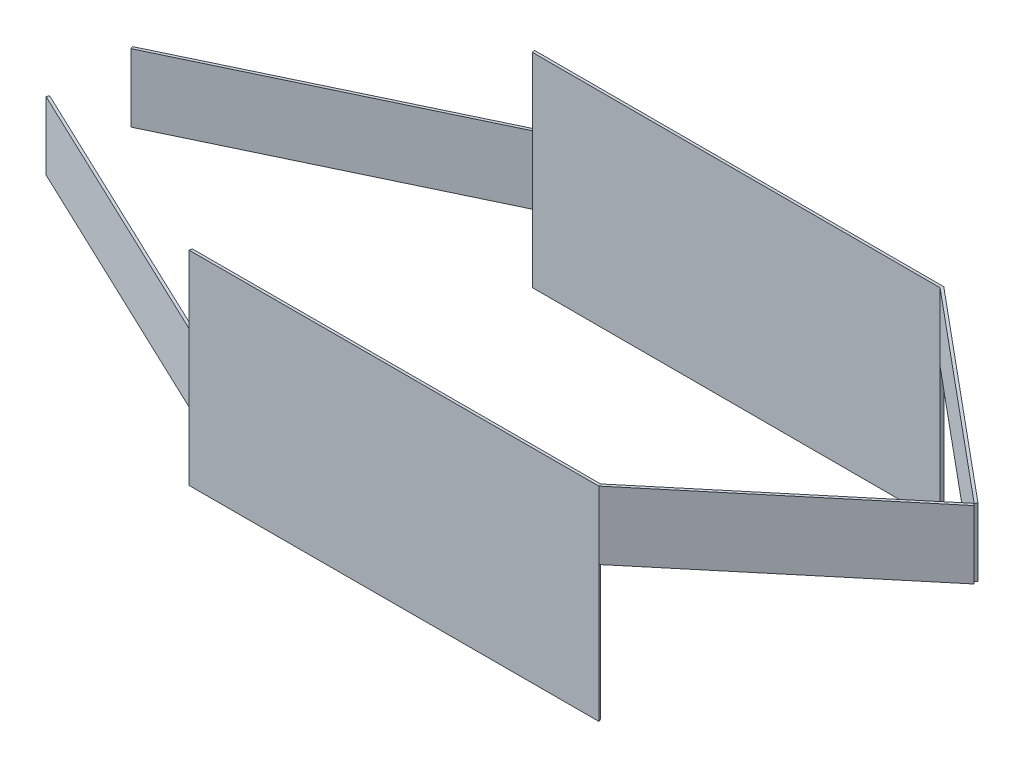
ISO-10303-21;
HEADER;
FILE_DESCRIPTION(('STEP AP214'),'2;1');
FILE_NAME('part.step','',(''),(''),'','','');
FILE_SCHEMA(('AUTOMOTIVE_DESIGN { 1 0 10303 214 1 1 1 1 }'));
ENDSEC;
DATA;
#1=APPLICATION_CONTEXT('core data for automotive mechanical design processes');
#2=APPLICATION_PROTOCOL_DEFINITION('international standard','automotive_design',2000,#1);
#3=PRODUCT_CONTEXT('',#1,'mechanical');
#4=PRODUCT('Part','Part','',(#3));
#5=PRODUCT_RELATED_PRODUCT_CATEGORY('part','',(#4));
#6=PRODUCT_DEFINITION_FORMATION('','',#4);
#7=PRODUCT_DEFINITION_CONTEXT('part definition',#1,'design');
#8=PRODUCT_DEFINITION('design','',#6,#7);
#9=PRODUCT_DEFINITION_SHAPE('','',#8);
#10=(LENGTH_UNIT() NAMED_UNIT(*) SI_UNIT(.MILLI.,.METRE.));
#11=(NAMED_UNIT(*) PLANE_ANGLE_UNIT() SI_UNIT($,.RADIAN.));
#12=(NAMED_UNIT(*) SI_UNIT($,.STERADIAN.) SOLID_ANGLE_UNIT());
#13=UNCERTAINTY_MEASURE_WITH_UNIT(LENGTH_MEASURE(1.E-05),#10,'distance_accuracy_value','');
#14=(GEOMETRIC_REPRESENTATION_CONTEXT(3) GLOBAL_UNCERTAINTY_ASSIGNED_CONTEXT((#13)) GLOBAL_UNIT_ASSIGNED_CONTEXT((#10,
#11,#12)) REPRESENTATION_CONTEXT('',''));
#15=CARTESIAN_POINT('',(0.,0.,0.));
#16=DIRECTION('',(0.,0.,1.));
#17=DIRECTION('',(1.,0.,0.));
#18=AXIS2_PLACEMENT_3D('',#15,#16,#17);
#19=CARTESIAN_POINT('',(23.3216797780839,-200.,11.0785547963605));
#20=DIRECTION('',(-0.903266142648768,0.,-0.429080733131209));
#21=DIRECTION('',(-0.42908073313121,0.,0.903266142648768));
#22=AXIS2_PLACEMENT_3D('',#19,#20,#21);
#23=PLANE('',#22);
#24=DIRECTION('',(-0.42908073313121,0.,0.903266142648768));
#25=VECTOR('',#24,1.);
#26=CARTESIAN_POINT('',(23.3216797780839,-100.,11.0785547963605));
#27=LINE('',#26,#25);
#28=CARTESIAN_POINT('',(0.0824257389479277,-100.,59.9999575374764));
#29=VERTEX_POINT('',#28);
#30=CARTESIAN_POINT('',(-1.63389719357689,-100.,63.6130221080714));
#31=VERTEX_POINT('',#30);
#32=EDGE_CURVE('E108',#29,#31,#27,.T.);
#33=ORIENTED_EDGE('',*,*,#32,.F.);
#34=DIRECTION('',(0.,1.,0.));
#35=VECTOR('',#34,1.);
#36=CARTESIAN_POINT('',(0.0824257389479277,-200.,59.9999575374764));
#37=LINE('',#36,#35);
#38=CARTESIAN_POINT('',(0.0824257389479277,-200.,59.9999575374764));
#39=VERTEX_POINT('',#38);
#40=EDGE_CURVE('E12',#39,#29,#37,.T.);
#41=ORIENTED_EDGE('',*,*,#40,.F.);
#42=DIRECTION('',(-0.42908073313121,0.,0.903266142648768));
#43=VECTOR('',#42,1.);
#44=CARTESIAN_POINT('',(23.3216797780839,-200.,11.0785547963605));
#45=LINE('',#44,#43);
#46=CARTESIAN_POINT('',(-1.63389719357689,-200.,63.6130221080714));
#47=VERTEX_POINT('',#46);
#48=EDGE_CURVE('E102',#39,#47,#45,.T.);
#49=ORIENTED_EDGE('',*,*,#48,.T.);
#50=DIRECTION('',(0.,1.,0.));
#51=VECTOR('',#50,1.);
#52=CARTESIAN_POINT('',(-1.63389719357689,-200.,63.6130221080714));
#53=LINE('',#52,#51);
#54=EDGE_CURVE('E47',#47,#31,#53,.T.);
#55=ORIENTED_EDGE('',*,*,#54,.T.);
#56=EDGE_LOOP('',(#33,#41,#49,#55));
#57=FACE_BOUND('',#56,.T.);
#58=ADVANCED_FACE('F44',(#57),#23,.T.);
#59=CARTESIAN_POINT('',(-23.239254039136,-200.,48.9214027411158));
#60=DIRECTION('',(0.42908073313121,0.,-0.903266142648768));
#61=DIRECTION('',(-0.903266142648768,0.,-0.42908073313121));
#62=AXIS2_PLACEMENT_3D('',#59,#60,#61);
#63=PLANE('',#62);
#64=DIRECTION('',(-0.903266142648768,0.,-0.42908073313121));
#65=VECTOR('',#64,1.);
#66=CARTESIAN_POINT('',(-23.239254039136,-100.,48.9214027411158));
#67=LINE('',#66,#65);
#68=CARTESIAN_POINT('',(400.34400674582,-100.,250.137198947916));
#69=VERTEX_POINT('',#68);
#70=EDGE_CURVE('E104',#69,#29,#67,.T.);
#71=ORIENTED_EDGE('',*,*,#70,.F.);
#72=DIRECTION('',(0.,1.,0.));
#73=VECTOR('',#72,1.);
#74=CARTESIAN_POINT('',(400.34400674582,-200.,250.137198947916));
#75=LINE('',#74,#73);
#76=CARTESIAN_POINT('',(400.34400674582,-200.,250.137198947916));
#77=VERTEX_POINT('',#76);
#78=EDGE_CURVE('E53',#77,#69,#75,.T.);
#79=ORIENTED_EDGE('',*,*,#78,.F.);
#80=DIRECTION('',(-0.903266142648768,0.,-0.42908073313121));
#81=VECTOR('',#80,1.);
#82=CARTESIAN_POINT('',(-23.239254039136,-200.,48.9214027411158));
#83=LINE('',#82,#81);
#84=EDGE_CURVE('E99',#77,#39,#83,.T.);
#85=ORIENTED_EDGE('',*,*,#84,.T.);
#86=ORIENTED_EDGE('',*,*,#40,.T.);
#87=EDGE_LOOP('',(#71,#79,#85,#86));
#88=FACE_BOUND('',#87,.T.);
#89=ADVANCED_FACE('F118',(#88),#63,.T.);
#90=CARTESIAN_POINT('',(434.607699966909,-200.,97.6662333135699));
#91=DIRECTION('',(0.975667654767498,0.,0.219254709049751));
#92=DIRECTION('',(0.219254709049751,0.,-0.975667654767498));
#93=AXIS2_PLACEMENT_3D('',#90,#91,#92);
#94=PLANE('',#93);
#95=DIRECTION('',(0.219254709049751,0.,-0.975667654767498));
#96=VECTOR('',#95,1.);
#97=CARTESIAN_POINT('',(434.607699966909,-100.,97.6662333135699));
#98=LINE('',#97,#96);
#99=CARTESIAN_POINT('',(399.444837348371,-100.,254.138437968273));
#100=VERTEX_POINT('',#99);
#101=EDGE_CURVE('E94',#100,#69,#98,.T.);
#102=ORIENTED_EDGE('',*,*,#101,.F.);
#103=DIRECTION('',(0.,1.,0.));
#104=VECTOR('',#103,1.);
#105=CARTESIAN_POINT('',(399.444837348371,-200.,254.138437968273));
#106=LINE('',#105,#104);
#107=CARTESIAN_POINT('',(399.444837348371,-200.,254.138437968273));
#108=VERTEX_POINT('',#107);
#109=EDGE_CURVE('E89',#108,#100,#106,.T.);
#110=ORIENTED_EDGE('',*,*,#109,.F.);
#111=DIRECTION('',(0.219254709049751,0.,-0.975667654767498));
#112=VECTOR('',#111,1.);
#113=CARTESIAN_POINT('',(434.607699966909,-200.,97.6662333135699));
#114=LINE('',#113,#112);
#115=EDGE_CURVE('E92',#108,#77,#114,.T.);
#116=ORIENTED_EDGE('',*,*,#115,.T.);
#117=ORIENTED_EDGE('',*,*,#78,.T.);
#118=EDGE_LOOP('',(#102,#110,#116,#117));
#119=FACE_BOUND('',#118,.T.);
#120=ADVANCED_FACE('F91',(#119),#94,.T.);
#121=CARTESIAN_POINT('',(-24.9555769716608,-200.,52.5344673117109));
#122=DIRECTION('',(-0.42908073313121,0.,0.903266142648768));
#123=DIRECTION('',(0.903266142648768,0.,0.42908073313121));
#124=AXIS2_PLACEMENT_3D('',#121,#122,#123);
#125=PLANE('',#124);
#126=DIRECTION('',(0.903266142648767,0.,0.42908073313121));
#127=VECTOR('',#126,1.);
#128=CARTESIAN_POINT('',(-24.9555769716608,-100.,52.5344673117109));
#129=LINE('',#128,#127);
#130=EDGE_CURVE('E111',#31,#100,#129,.T.);
#131=ORIENTED_EDGE('',*,*,#130,.F.);
#132=ORIENTED_EDGE('',*,*,#54,.F.);
#133=DIRECTION('',(0.903266142648767,0.,0.42908073313121));
#134=VECTOR('',#133,1.);
#135=CARTESIAN_POINT('',(-24.9555769716608,-200.,52.5344673117109));
#136=LINE('',#135,#134);
#137=EDGE_CURVE('E98',#47,#108,#136,.T.);
#138=ORIENTED_EDGE('',*,*,#137,.T.);
#139=ORIENTED_EDGE('',*,*,#109,.T.);
#140=EDGE_LOOP('',(#131,#132,#138,#139));
#141=FACE_BOUND('',#140,.T.);
#142=ADVANCED_FACE('F101',(#141),#125,.T.);
#143=CARTESIAN_POINT('',(0.,-200.,0.));
#144=DIRECTION('',(0.,1.,0.));
#145=DIRECTION('',(0.,0.,1.));
#146=AXIS2_PLACEMENT_3D('',#143,#144,#145);
#147=PLANE('',#146);
#148=ORIENTED_EDGE('',*,*,#48,.F.);
#149=ORIENTED_EDGE('',*,*,#84,.F.);
#150=ORIENTED_EDGE('',*,*,#115,.F.);
#151=ORIENTED_EDGE('',*,*,#137,.F.);
#152=EDGE_LOOP('',(#148,#149,#150,#151));
#153=FACE_BOUND('',#152,.T.);
#154=ADVANCED_FACE('F97',(#153),#147,.F.);
#155=CARTESIAN_POINT('',(0.,-100.,0.));
#156=DIRECTION('',(0.,1.,0.));
#157=DIRECTION('',(0.,0.,1.));
#158=AXIS2_PLACEMENT_3D('',#155,#156,#157);
#159=PLANE('',#158);
#160=ORIENTED_EDGE('',*,*,#32,.T.);
#161=ORIENTED_EDGE('',*,*,#130,.T.);
#162=ORIENTED_EDGE('',*,*,#101,.T.);
#163=ORIENTED_EDGE('',*,*,#70,.T.);
#164=EDGE_LOOP('',(#160,#161,#162,#163));
#165=FACE_BOUND('',#164,.T.);
#166=ADVANCED_FACE('F117',(#165),#159,.T.);
#167=CLOSED_SHELL('',(#58,#89,#120,#142,#154,#166));
#168=MANIFOLD_SOLID_BREP('B2',#167);
#169=CARTESIAN_POINT('',(800.07808389762,-100.,-294.589469564299));
#170=DIRECTION('',(0.93841011646661,0.,-0.345523448282637));
#171=DIRECTION('',(-0.345523448282637,0.,-0.93841011646661));
#172=AXIS2_PLACEMENT_3D('',#169,#170,#171);
#173=PLANE('',#172);
#174=DIRECTION('',(-0.345523448282637,0.,-0.93841011646661));
#175=VECTOR('',#174,1.);
#176=CARTESIAN_POINT('',(800.07808389762,0.,-294.589469564299));
#177=LINE('',#176,#175);
#178=CARTESIAN_POINT('',(1001.81550096484,0.,253.310923264815));
#179=VERTEX_POINT('',#178);
#180=CARTESIAN_POINT('',(1000.34344057895,0.,249.312941752881));
#181=VERTEX_POINT('',#180);
#182=EDGE_CURVE('E242',#179,#181,#177,.T.);
#183=ORIENTED_EDGE('',*,*,#182,.T.);
#184=DIRECTION('',(0.,1.,0.));
#185=VECTOR('',#184,1.);
#186=CARTESIAN_POINT('',(1000.34344057895,-100.,249.312941752881));
#187=LINE('',#186,#185);
#188=CARTESIAN_POINT('',(1000.34344057895,-100.,249.312941752881));
#189=VERTEX_POINT('',#188);
#190=EDGE_CURVE('E42',#189,#181,#187,.T.);
#191=ORIENTED_EDGE('',*,*,#190,.F.);
#192=DIRECTION('',(-0.345523448282637,0.,-0.93841011646661));
#193=VECTOR('',#192,1.);
#194=CARTESIAN_POINT('',(800.07808389762,-100.,-294.589469564299));
#195=LINE('',#194,#193);
#196=CARTESIAN_POINT('',(1001.81550096484,-100.,253.310923264815));
#197=VERTEX_POINT('',#196);
#198=EDGE_CURVE('E237',#197,#189,#195,.T.);
#199=ORIENTED_EDGE('',*,*,#198,.F.);
#200=DIRECTION('',(0.,1.,0.));
#201=VECTOR('',#200,1.);
#202=CARTESIAN_POINT('',(1001.81550096484,-100.,253.310923264815));
#203=LINE('',#202,#201);
#204=EDGE_CURVE('E181',#197,#179,#203,.T.);
#205=ORIENTED_EDGE('',*,*,#204,.T.);
#206=EDGE_LOOP('',(#183,#191,#199,#205));
#207=FACE_BOUND('',#206,.T.);
#208=ADVANCED_FACE('F178',(#207),#173,.F.);
#209=CARTESIAN_POINT('',(533.58603786094,-100.,639.043940484648));
#210=DIRECTION('',(0.640928021038289,0.,0.767600984788283));
#211=DIRECTION('',(0.767600984788283,0.,-0.640928021038289));
#212=AXIS2_PLACEMENT_3D('',#209,#210,#211);
#213=PLANE('',#212);
#214=DIRECTION('',(0.767600984788283,0.,-0.640928021038289));
#215=VECTOR('',#214,1.);
#216=CARTESIAN_POINT('',(533.58603786094,0.,639.043940484648));
#217=LINE('',#216,#215);
#218=CARTESIAN_POINT('',(1300.,0.,-0.892945715917692));
#219=VERTEX_POINT('',#218);
#220=EDGE_CURVE('E209',#181,#219,#217,.T.);
#221=ORIENTED_EDGE('',*,*,#220,.T.);
#222=DIRECTION('',(0.,1.,0.));
#223=VECTOR('',#222,1.);
#224=CARTESIAN_POINT('',(1300.,-100.,-0.892945715917692));
#225=LINE('',#224,#223);
#226=CARTESIAN_POINT('',(1300.,-100.,-0.892945715917692));
#227=VERTEX_POINT('',#226);
#228=EDGE_CURVE('E187',#227,#219,#225,.T.);
#229=ORIENTED_EDGE('',*,*,#228,.F.);
#230=DIRECTION('',(0.767600984788283,0.,-0.640928021038289));
#231=VECTOR('',#230,1.);
#232=CARTESIAN_POINT('',(533.58603786094,-100.,639.043940484648));
#233=LINE('',#232,#231);
#234=EDGE_CURVE('E195',#189,#227,#233,.T.);
#235=ORIENTED_EDGE('',*,*,#234,.F.);
#236=ORIENTED_EDGE('',*,*,#190,.T.);
#237=EDGE_LOOP('',(#221,#229,#235,#236));
#238=FACE_BOUND('',#237,.T.);
#239=ADVANCED_FACE('F252',(#238),#213,.F.);
#240=CARTESIAN_POINT('',(766.413962139162,-100.,-639.936886200547));
#241=DIRECTION('',(-0.767600984788335,0.,0.640928021038228));
#242=DIRECTION('',(0.640928021038228,0.,0.767600984788335));
#243=AXIS2_PLACEMENT_3D('',#240,#241,#242);
#244=PLANE('',#243);
#245=DIRECTION('',(0.640928021038228,0.,0.767600984788335));
#246=VECTOR('',#245,1.);
#247=CARTESIAN_POINT('',(766.413962139162,0.,-639.936886200547));
#248=LINE('',#247,#246);
#249=CARTESIAN_POINT('',(1302.57162068453,0.,2.18692987877067));
#250=VERTEX_POINT('',#249);
#251=EDGE_CURVE('E234',#219,#250,#248,.T.);
#252=ORIENTED_EDGE('',*,*,#251,.T.);
#253=DIRECTION('',(0.,1.,0.));
#254=VECTOR('',#253,1.);
#255=CARTESIAN_POINT('',(1302.57162068453,-100.,2.18692987877067));
#256=LINE('',#255,#254);
#257=CARTESIAN_POINT('',(1302.57162068453,-100.,2.18692987877067));
#258=VERTEX_POINT('',#257);
#259=EDGE_CURVE('E232',#258,#250,#256,.T.);
#260=ORIENTED_EDGE('',*,*,#259,.F.);
#261=DIRECTION('',(0.640928021038228,0.,0.767600984788335));
#262=VECTOR('',#261,1.);
#263=CARTESIAN_POINT('',(766.413962139162,-100.,-639.936886200547));
#264=LINE('',#263,#262);
#265=EDGE_CURVE('E225',#227,#258,#264,.T.);
#266=ORIENTED_EDGE('',*,*,#265,.F.);
#267=ORIENTED_EDGE('',*,*,#228,.T.);
#268=EDGE_LOOP('',(#252,#260,#266,#267));
#269=FACE_BOUND('',#268,.T.);
#270=ADVANCED_FACE('F233',(#269),#244,.F.);
#271=CARTESIAN_POINT('',(536.157658545473,-100.,642.123816079337));
#272=DIRECTION('',(0.64092802103829,0.,0.767600984788282));
#273=DIRECTION('',(0.767600984788282,0.,-0.640928021038291));
#274=AXIS2_PLACEMENT_3D('',#271,#272,#273);
#275=PLANE('',#274);
#276=DIRECTION('',(0.767600984788282,0.,-0.640928021038291));
#277=VECTOR('',#276,1.);
#278=CARTESIAN_POINT('',(536.157658545473,0.,642.123816079337));
#279=LINE('',#278,#277);
#280=EDGE_CURVE('E245',#179,#250,#279,.T.);
#281=ORIENTED_EDGE('',*,*,#280,.F.);
#282=ORIENTED_EDGE('',*,*,#204,.F.);
#283=DIRECTION('',(0.767600984788282,0.,-0.640928021038291));
#284=VECTOR('',#283,1.);
#285=CARTESIAN_POINT('',(536.157658545473,-100.,642.123816079337));
#286=LINE('',#285,#284);
#287=EDGE_CURVE('E228',#197,#258,#286,.T.);
#288=ORIENTED_EDGE('',*,*,#287,.T.);
#289=ORIENTED_EDGE('',*,*,#259,.T.);
#290=EDGE_LOOP('',(#281,#282,#288,#289));
#291=FACE_BOUND('',#290,.T.);
#292=ADVANCED_FACE('F236',(#291),#275,.T.);
#293=CARTESIAN_POINT('',(0.,-100.,0.));
#294=DIRECTION('',(0.,1.,0.));
#295=DIRECTION('',(0.,0.,1.));
#296=AXIS2_PLACEMENT_3D('',#293,#294,#295);
#297=PLANE('',#296);
#298=ORIENTED_EDGE('',*,*,#198,.T.);
#299=ORIENTED_EDGE('',*,*,#234,.T.);
#300=ORIENTED_EDGE('',*,*,#265,.T.);
#301=ORIENTED_EDGE('',*,*,#287,.F.);
#302=EDGE_LOOP('',(#298,#299,#300,#301));
#303=FACE_BOUND('',#302,.T.);
#304=ADVANCED_FACE('F227',(#303),#297,.F.);
#305=CARTESIAN_POINT('',(0.,0.,0.));
#306=DIRECTION('',(0.,1.,0.));
#307=DIRECTION('',(0.,0.,1.));
#308=AXIS2_PLACEMENT_3D('',#305,#306,#307);
#309=PLANE('',#308);
#310=ORIENTED_EDGE('',*,*,#182,.F.);
#311=ORIENTED_EDGE('',*,*,#280,.T.);
#312=ORIENTED_EDGE('',*,*,#251,.F.);
#313=ORIENTED_EDGE('',*,*,#220,.F.);
#314=EDGE_LOOP('',(#310,#311,#312,#313));
#315=FACE_BOUND('',#314,.T.);
#316=ADVANCED_FACE('F249',(#315),#309,.T.);
#317=CLOSED_SHELL('',(#208,#239,#270,#292,#304,#316));
#318=MANIFOLD_SOLID_BREP('B6',#317);
#319=CARTESIAN_POINT('',(434.607699966909,-300.,97.6662333135699));
#320=DIRECTION('',(0.975667654767498,0.,0.219254709049751));
#321=DIRECTION('',(0.219254709049751,0.,-0.975667654767498));
#322=AXIS2_PLACEMENT_3D('',#319,#320,#321);
#323=PLANE('',#322);
#324=DIRECTION('',(0.219254709049751,0.,-0.975667654767498));
#325=VECTOR('',#324,1.);
#326=CARTESIAN_POINT('',(434.607699966909,0.,97.6662333135699));
#327=LINE('',#326,#325);
#328=CARTESIAN_POINT('',(399.444837348371,0.,254.138437968273));
#329=VERTEX_POINT('',#328);
#330=CARTESIAN_POINT('',(400.34400674582,0.,250.137198947916));
#331=VERTEX_POINT('',#330);
#332=EDGE_CURVE('E375',#329,#331,#327,.T.);
#333=ORIENTED_EDGE('',*,*,#332,.T.);
#334=DIRECTION('',(0.,1.,0.));
#335=VECTOR('',#334,1.);
#336=CARTESIAN_POINT('',(400.34400674582,-300.,250.137198947916));
#337=LINE('',#336,#335);
#338=CARTESIAN_POINT('',(400.34400674582,-300.,250.137198947916));
#339=VERTEX_POINT('',#338);
#340=EDGE_CURVE('E176',#339,#331,#337,.T.);
#341=ORIENTED_EDGE('',*,*,#340,.F.);
#342=DIRECTION('',(0.219254709049751,0.,-0.975667654767498));
#343=VECTOR('',#342,1.);
#344=CARTESIAN_POINT('',(434.607699966909,-300.,97.6662333135699));
#345=LINE('',#344,#343);
#346=CARTESIAN_POINT('',(399.444837348371,-300.,254.138437968273));
#347=VERTEX_POINT('',#346);
#348=EDGE_CURVE('E370',#347,#339,#345,.T.);
#349=ORIENTED_EDGE('',*,*,#348,.F.);
#350=DIRECTION('',(0.,1.,0.));
#351=VECTOR('',#350,1.);
#352=CARTESIAN_POINT('',(399.444837348371,-300.,254.138437968273));
#353=LINE('',#352,#351);
#354=EDGE_CURVE('E314',#347,#329,#353,.T.);
#355=ORIENTED_EDGE('',*,*,#354,.T.);
#356=EDGE_LOOP('',(#333,#341,#349,#355));
#357=FACE_BOUND('',#356,.T.);
#358=ADVANCED_FACE('F311',(#357),#323,.F.);
#359=CARTESIAN_POINT('',(0.344384190399861,-300.,250.686703744606));
#360=DIRECTION('',(0.00137376199172432,0.,0.99999905638855));
#361=DIRECTION('',(0.99999905638855,0.,-0.00137376199172432));
#362=AXIS2_PLACEMENT_3D('',#359,#360,#361);
#363=PLANE('',#362);
#364=DIRECTION('',(0.99999905638855,0.,-0.00137376199172432));
#365=VECTOR('',#364,1.);
#366=CARTESIAN_POINT('',(0.344384190399861,0.,250.686703744606));
#367=LINE('',#366,#365);
#368=CARTESIAN_POINT('',(1000.34344057895,0.,249.312941752881));
#369=VERTEX_POINT('',#368);
#370=EDGE_CURVE('E350',#331,#369,#367,.T.);
#371=ORIENTED_EDGE('',*,*,#370,.T.);
#372=DIRECTION('',(0.,1.,0.));
#373=VECTOR('',#372,1.);
#374=CARTESIAN_POINT('',(1000.34344057895,-300.,249.312941752881));
#375=LINE('',#374,#373);
#376=CARTESIAN_POINT('',(1000.34344057895,-300.,249.312941752881));
#377=VERTEX_POINT('',#376);
#378=EDGE_CURVE('E320',#377,#369,#375,.T.);
#379=ORIENTED_EDGE('',*,*,#378,.F.);
#380=DIRECTION('',(0.99999905638855,0.,-0.00137376199172432));
#381=VECTOR('',#380,1.);
#382=CARTESIAN_POINT('',(0.344384190399861,-300.,250.686703744606));
#383=LINE('',#382,#381);
#384=EDGE_CURVE('E328',#339,#377,#383,.T.);
#385=ORIENTED_EDGE('',*,*,#384,.F.);
#386=ORIENTED_EDGE('',*,*,#340,.T.);
#387=EDGE_LOOP('',(#371,#379,#385,#386));
#388=FACE_BOUND('',#387,.T.);
#389=ADVANCED_FACE('F382',(#388),#363,.F.);
#390=CARTESIAN_POINT('',(800.07808389762,-300.,-294.589469564299));
#391=DIRECTION('',(0.93841011646661,0.,-0.345523448282637));
#392=DIRECTION('',(-0.345523448282637,0.,-0.93841011646661));
#393=AXIS2_PLACEMENT_3D('',#390,#391,#392);
#394=PLANE('',#393);
#395=DIRECTION('',(-0.345523448282637,0.,-0.93841011646661));
#396=VECTOR('',#395,1.);
#397=CARTESIAN_POINT('',(800.07808389762,0.,-294.589469564299));
#398=LINE('',#397,#396);
#399=CARTESIAN_POINT('',(1001.81550096484,0.,253.310923264815));
#400=VERTEX_POINT('',#399);
#401=EDGE_CURVE('E362',#400,#369,#398,.T.);
#402=ORIENTED_EDGE('',*,*,#401,.F.);
#403=DIRECTION('',(0.,1.,0.));
#404=VECTOR('',#403,1.);
#405=CARTESIAN_POINT('',(1001.81550096484,-300.,253.310923264815));
#406=LINE('',#405,#404);
#407=CARTESIAN_POINT('',(1001.81550096484,-300.,253.310923264815));
#408=VERTEX_POINT('',#407);
#409=EDGE_CURVE('E358',#408,#400,#406,.T.);
#410=ORIENTED_EDGE('',*,*,#409,.F.);
#411=DIRECTION('',(-0.345523448282637,0.,-0.93841011646661));
#412=VECTOR('',#411,1.);
#413=CARTESIAN_POINT('',(800.07808389762,-300.,-294.589469564299));
#414=LINE('',#413,#412);
#415=EDGE_CURVE('E361',#408,#377,#414,.T.);
#416=ORIENTED_EDGE('',*,*,#415,.T.);
#417=ORIENTED_EDGE('',*,*,#378,.T.);
#418=EDGE_LOOP('',(#402,#410,#416,#417));
#419=FACE_BOUND('',#418,.T.);
#420=ADVANCED_FACE('F360',(#419),#394,.T.);
#421=CARTESIAN_POINT('',(0.349879238366764,-300.,254.68669997016));
#422=DIRECTION('',(0.00137376199172435,0.,0.99999905638855));
#423=DIRECTION('',(0.99999905638855,0.,-0.00137376199172435));
#424=AXIS2_PLACEMENT_3D('',#421,#422,#423);
#425=PLANE('',#424);
#426=DIRECTION('',(0.99999905638855,0.,-0.00137376199172435));
#427=VECTOR('',#426,1.);
#428=CARTESIAN_POINT('',(0.349879238366764,0.,254.68669997016));
#429=LINE('',#428,#427);
#430=EDGE_CURVE('E378',#329,#400,#429,.T.);
#431=ORIENTED_EDGE('',*,*,#430,.F.);
#432=ORIENTED_EDGE('',*,*,#354,.F.);
#433=DIRECTION('',(0.99999905638855,0.,-0.00137376199172435));
#434=VECTOR('',#433,1.);
#435=CARTESIAN_POINT('',(0.349879238366764,-300.,254.68669997016));
#436=LINE('',#435,#434);
#437=EDGE_CURVE('E367',#347,#408,#436,.T.);
#438=ORIENTED_EDGE('',*,*,#437,.T.);
#439=ORIENTED_EDGE('',*,*,#409,.T.);
#440=EDGE_LOOP('',(#431,#432,#438,#439));
#441=FACE_BOUND('',#440,.T.);
#442=ADVANCED_FACE('F369',(#441),#425,.T.);
#443=CARTESIAN_POINT('',(0.,-300.,0.));
#444=DIRECTION('',(0.,1.,0.));
#445=DIRECTION('',(0.,0.,1.));
#446=AXIS2_PLACEMENT_3D('',#443,#444,#445);
#447=PLANE('',#446);
#448=ORIENTED_EDGE('',*,*,#348,.T.);
#449=ORIENTED_EDGE('',*,*,#384,.T.);
#450=ORIENTED_EDGE('',*,*,#415,.F.);
#451=ORIENTED_EDGE('',*,*,#437,.F.);
#452=EDGE_LOOP('',(#448,#449,#450,#451));
#453=FACE_BOUND('',#452,.T.);
#454=ADVANCED_FACE('F366',(#453),#447,.F.);
#455=CARTESIAN_POINT('',(0.,0.,0.));
#456=DIRECTION('',(0.,1.,0.));
#457=DIRECTION('',(0.,0.,1.));
#458=AXIS2_PLACEMENT_3D('',#455,#456,#457);
#459=PLANE('',#458);
#460=ORIENTED_EDGE('',*,*,#332,.F.);
#461=ORIENTED_EDGE('',*,*,#430,.T.);
#462=ORIENTED_EDGE('',*,*,#401,.T.);
#463=ORIENTED_EDGE('',*,*,#370,.F.);
#464=EDGE_LOOP('',(#460,#461,#462,#463));
#465=FACE_BOUND('',#464,.T.);
#466=ADVANCED_FACE('F384',(#465),#459,.T.);
#467=CLOSED_SHELL('',(#358,#389,#420,#442,#454,#466));
#468=MANIFOLD_SOLID_BREP('B36',#467);
#469=CARTESIAN_POINT('',(434.473119706905,-300.,-98.2631886941113));
#470=DIRECTION('',(-0.975365530330532,0.,0.220594837299155));
#471=DIRECTION('',(0.220594837299155,0.,0.975365530330532));
#472=AXIS2_PLACEMENT_3D('',#469,#470,#471);
#473=PLANE('',#472);
#474=DIRECTION('',(0.,1.,0.));
#475=VECTOR('',#474,1.);
#476=CARTESIAN_POINT('',(399.095334700932,-300.,-254.686940295673));
#477=LINE('',#476,#475);
#478=CARTESIAN_POINT('',(399.095334700932,-100.,-254.686940295673));
#479=VERTEX_POINT('',#478);
#480=CARTESIAN_POINT('',(399.095334700932,0.,-254.686940295673));
#481=VERTEX_POINT('',#480);
#482=EDGE_CURVE('E457',#479,#481,#477,.T.);
#483=ORIENTED_EDGE('',*,*,#482,.F.);
#484=DIRECTION('',(0.220594837299155,0.,0.975365530330532));
#485=VECTOR('',#484,1.);
#486=CARTESIAN_POINT('',(434.473119706905,-100.,-98.2631886941113));
#487=LINE('',#486,#485);
#488=CARTESIAN_POINT('',(400.,-100.,-250.686940295673));
#489=VERTEX_POINT('',#488);
#490=EDGE_CURVE('E452',#479,#489,#487,.T.);
#491=ORIENTED_EDGE('',*,*,#490,.T.);
#492=DIRECTION('',(0.,1.,0.));
#493=VECTOR('',#492,1.);
#494=CARTESIAN_POINT('',(400.,-300.,-250.686940295673));
#495=LINE('',#494,#493);
#496=CARTESIAN_POINT('',(400.,0.,-250.686940295673));
#497=VERTEX_POINT('',#496);
#498=EDGE_CURVE('E604',#489,#497,#495,.T.);
#499=ORIENTED_EDGE('',*,*,#498,.T.);
#500=DIRECTION('',(0.220594837299155,0.,0.975365530330532));
#501=VECTOR('',#500,1.);
#502=CARTESIAN_POINT('',(434.473119706905,0.,-98.2631886941113));
#503=LINE('',#502,#501);
#504=EDGE_CURVE('E620',#481,#497,#503,.T.);
#505=ORIENTED_EDGE('',*,*,#504,.F.);
#506=EDGE_LOOP('',(#483,#491,#499,#505));
#507=FACE_BOUND('',#506,.T.);
#508=ADVANCED_FACE('F435',(#507),#473,.T.);
#509=CARTESIAN_POINT('',(0.,-300.,-254.686940295673));
#510=DIRECTION('',(0.,0.,1.));
#511=DIRECTION('',(1.,0.,0.));
#512=AXIS2_PLACEMENT_3D('',#509,#510,#511);
#513=PLANE('',#512);
#514=DIRECTION('',(1.,0.,0.));
#515=VECTOR('',#514,1.);
#516=CARTESIAN_POINT('',(0.,0.,-254.686940295673));
#517=LINE('',#516,#515);
#518=CARTESIAN_POINT('',(1001.4665667218,0.,-254.686940295673));
#519=VERTEX_POINT('',#518);
#520=EDGE_CURVE('E593',#481,#519,#517,.T.);
#521=ORIENTED_EDGE('',*,*,#520,.T.);
#522=DIRECTION('',(0.,1.,0.));
#523=VECTOR('',#522,1.);
#524=CARTESIAN_POINT('',(1001.4665667218,-100.,-254.686940295673));
#525=LINE('',#524,#523);
#526=CARTESIAN_POINT('',(1001.4665667218,-100.,-254.686940295673));
#527=VERTEX_POINT('',#526);
#528=EDGE_CURVE('E591',#527,#519,#525,.T.);
#529=ORIENTED_EDGE('',*,*,#528,.F.);
#530=DIRECTION('',(0.,1.,0.));
#531=VECTOR('',#530,1.);
#532=CARTESIAN_POINT('',(1001.4665667218,-300.,-254.686940295673));
#533=LINE('',#532,#531);
#534=CARTESIAN_POINT('',(1001.4665667218,-300.,-254.686940295673));
#535=VERTEX_POINT('',#534);
#536=EDGE_CURVE('E309',#535,#527,#533,.T.);
#537=ORIENTED_EDGE('',*,*,#536,.F.);
#538=DIRECTION('',(1.,0.,0.));
#539=VECTOR('',#538,1.);
#540=CARTESIAN_POINT('',(0.,-300.,-254.686940295673));
#541=LINE('',#540,#539);
#542=CARTESIAN_POINT('',(399.095334700932,-300.,-254.686940295673));
#543=VERTEX_POINT('',#542);
#544=EDGE_CURVE('E619',#543,#535,#541,.T.);
#545=ORIENTED_EDGE('',*,*,#544,.F.);
#546=CARTESIAN_POINT('',(399.095334700932,-200.,-254.686940295673));
#547=VERTEX_POINT('',#546);
#548=EDGE_CURVE('E600',#543,#547,#477,.T.);
#549=ORIENTED_EDGE('',*,*,#548,.T.);
#550=DIRECTION('',(0.,1.,0.));
#551=VECTOR('',#550,1.);
#552=CARTESIAN_POINT('',(399.095334700932,-200.,-254.686940295673));
#553=LINE('',#552,#551);
#554=EDGE_CURVE('E541',#547,#479,#553,.T.);
#555=ORIENTED_EDGE('',*,*,#554,.T.);
#556=ORIENTED_EDGE('',*,*,#482,.T.);
#557=EDGE_LOOP('',(#521,#529,#537,#545,#549,#555,#556));
#558=FACE_BOUND('',#557,.T.);
#559=ADVANCED_FACE('F437',(#558),#513,.F.);
#560=CARTESIAN_POINT('',(800.482024751228,-300.,293.490074724233));
#561=DIRECTION('',(-0.938883897952579,0.,-0.344233970092105));
#562=DIRECTION('',(-0.344233970092105,0.,0.938883897952579));
#563=AXIS2_PLACEMENT_3D('',#560,#561,#562);
#564=PLANE('',#563);
#565=ORIENTED_EDGE('',*,*,#536,.T.);
#566=DIRECTION('',(-0.344233970092105,0.,0.938883897952579));
#567=VECTOR('',#566,1.);
#568=CARTESIAN_POINT('',(800.482024751228,-100.,293.490074724233));
#569=LINE('',#568,#567);
#570=CARTESIAN_POINT('',(1000.,-100.,-250.686940295673));
#571=VERTEX_POINT('',#570);
#572=EDGE_CURVE('E573',#527,#571,#569,.T.);
#573=ORIENTED_EDGE('',*,*,#572,.T.);
#574=DIRECTION('',(0.,1.,0.));
#575=VECTOR('',#574,1.);
#576=CARTESIAN_POINT('',(1000.,-300.,-250.686940295673));
#577=LINE('',#576,#575);
#578=CARTESIAN_POINT('',(1000.,-300.,-250.686940295673));
#579=VERTEX_POINT('',#578);
#580=EDGE_CURVE('E444',#579,#571,#577,.T.);
#581=ORIENTED_EDGE('',*,*,#580,.F.);
#582=DIRECTION('',(-0.344233970092105,0.,0.938883897952579));
#583=VECTOR('',#582,1.);
#584=CARTESIAN_POINT('',(800.482024751228,-300.,293.490074724233));
#585=LINE('',#584,#583);
#586=EDGE_CURVE('E625',#535,#579,#585,.T.);
#587=ORIENTED_EDGE('',*,*,#586,.F.);
#588=EDGE_LOOP('',(#565,#573,#581,#587));
#589=FACE_BOUND('',#588,.T.);
#590=ADVANCED_FACE('F674',(#589),#564,.F.);
#591=CARTESIAN_POINT('',(0.,-300.,-250.686940295673));
#592=DIRECTION('',(0.,0.,1.));
#593=DIRECTION('',(1.,0.,0.));
#594=AXIS2_PLACEMENT_3D('',#591,#592,#593);
#595=PLANE('',#594);
#596=DIRECTION('',(1.,0.,0.));
#597=VECTOR('',#596,1.);
#598=CARTESIAN_POINT('',(0.,0.,-250.686940295673));
#599=LINE('',#598,#597);
#600=CARTESIAN_POINT('',(1000.,0.,-250.686940295673));
#601=VERTEX_POINT('',#600);
#602=EDGE_CURVE('E616',#497,#601,#599,.T.);
#603=ORIENTED_EDGE('',*,*,#602,.F.);
#604=ORIENTED_EDGE('',*,*,#498,.F.);
#605=DIRECTION('',(0.,1.,0.));
#606=VECTOR('',#605,1.);
#607=CARTESIAN_POINT('',(400.,-200.,-250.686940295673));
#608=LINE('',#607,#606);
#609=CARTESIAN_POINT('',(400.,-200.,-250.686940295673));
#610=VERTEX_POINT('',#609);
#611=EDGE_CURVE('E566',#610,#489,#608,.T.);
#612=ORIENTED_EDGE('',*,*,#611,.F.);
#613=CARTESIAN_POINT('',(400.,-300.,-250.686940295673));
#614=VERTEX_POINT('',#613);
#615=EDGE_CURVE('E612',#614,#610,#495,.T.);
#616=ORIENTED_EDGE('',*,*,#615,.F.);
#617=DIRECTION('',(1.,0.,0.));
#618=VECTOR('',#617,1.);
#619=CARTESIAN_POINT('',(0.,-300.,-250.686940295673));
#620=LINE('',#619,#618);
#621=EDGE_CURVE('E627',#614,#579,#620,.T.);
#622=ORIENTED_EDGE('',*,*,#621,.T.);
#623=ORIENTED_EDGE('',*,*,#580,.T.);
#624=DIRECTION('',(0.,1.,0.));
#625=VECTOR('',#624,1.);
#626=CARTESIAN_POINT('',(1000.,-100.,-250.686940295673));
#627=LINE('',#626,#625);
#628=EDGE_CURVE('E584',#571,#601,#627,.T.);
#629=ORIENTED_EDGE('',*,*,#628,.T.);
#630=EDGE_LOOP('',(#603,#604,#612,#616,#622,#623,#629));
#631=FACE_BOUND('',#630,.T.);
#632=ADVANCED_FACE('F658',(#631),#595,.T.);
#633=DIRECTION('',(0.220594837299155,0.,0.975365530330532));
#634=VECTOR('',#633,1.);
#635=CARTESIAN_POINT('',(434.473119706905,-200.,-98.2631886941113));
#636=LINE('',#635,#634);
#637=EDGE_CURVE('E544',#547,#610,#636,.T.);
#638=ORIENTED_EDGE('',*,*,#637,.F.);
#639=ORIENTED_EDGE('',*,*,#548,.F.);
#640=DIRECTION('',(0.220594837299155,0.,0.975365530330532));
#641=VECTOR('',#640,1.);
#642=CARTESIAN_POINT('',(434.473119706905,-300.,-98.2631886941113));
#643=LINE('',#642,#641);
#644=EDGE_CURVE('E630',#543,#614,#643,.T.);
#645=ORIENTED_EDGE('',*,*,#644,.T.);
#646=ORIENTED_EDGE('',*,*,#615,.T.);
#647=EDGE_LOOP('',(#638,#639,#645,#646));
#648=FACE_BOUND('',#647,.T.);
#649=ADVANCED_FACE('F653',(#648),#473,.T.);
#650=CARTESIAN_POINT('',(0.,-300.,0.));
#651=DIRECTION('',(0.,1.,0.));
#652=DIRECTION('',(0.,0.,1.));
#653=AXIS2_PLACEMENT_3D('',#650,#651,#652);
#654=PLANE('',#653);
#655=ORIENTED_EDGE('',*,*,#544,.T.);
#656=ORIENTED_EDGE('',*,*,#586,.T.);
#657=ORIENTED_EDGE('',*,*,#621,.F.);
#658=ORIENTED_EDGE('',*,*,#644,.F.);
#659=EDGE_LOOP('',(#655,#656,#657,#658));
#660=FACE_BOUND('',#659,.T.);
#661=ADVANCED_FACE('F678',(#660),#654,.F.);
#662=CARTESIAN_POINT('',(0.,0.,0.));
#663=DIRECTION('',(0.,1.,0.));
#664=DIRECTION('',(0.,0.,1.));
#665=AXIS2_PLACEMENT_3D('',#662,#663,#664);
#666=PLANE('',#665);
#667=ORIENTED_EDGE('',*,*,#520,.F.);
#668=ORIENTED_EDGE('',*,*,#504,.T.);
#669=ORIENTED_EDGE('',*,*,#602,.T.);
#670=DIRECTION('',(0.768480743025938,0.,0.639872915193558));
#671=VECTOR('',#670,1.);
#672=CARTESIAN_POINT('',(532.707640086567,0.,-639.776357693597));
#673=LINE('',#672,#671);
#674=CARTESIAN_POINT('',(1300.,0.,-0.892945715917692));
#675=VERTEX_POINT('',#674);
#676=EDGE_CURVE('E641',#601,#675,#673,.T.);
#677=ORIENTED_EDGE('',*,*,#676,.T.);
#678=DIRECTION('',(0.639872915193564,0.,-0.768480743025933));
#679=VECTOR('',#678,1.);
#680=CARTESIAN_POINT('',(767.292359913424,0.,638.883411977681));
#681=LINE('',#680,#679);
#682=CARTESIAN_POINT('',(1302.56738724189,0.,-3.97635119915385));
#683=VERTEX_POINT('',#682);
#684=EDGE_CURVE('E639',#675,#683,#681,.T.);
#685=ORIENTED_EDGE('',*,*,#684,.T.);
#686=DIRECTION('',(0.768480743025937,0.,0.639872915193558));
#687=VECTOR('',#686,1.);
#688=CARTESIAN_POINT('',(535.275027328456,0.,-642.859763176833));
#689=LINE('',#688,#687);
#690=EDGE_CURVE('E577',#519,#683,#689,.T.);
#691=ORIENTED_EDGE('',*,*,#690,.F.);
#692=EDGE_LOOP('',(#667,#668,#669,#677,#685,#691));
#693=FACE_BOUND('',#692,.T.);
#694=ADVANCED_FACE('F683',(#693),#666,.T.);
#695=CARTESIAN_POINT('',(535.275027328456,-100.,-642.859763176833));
#696=DIRECTION('',(-0.639872915193558,0.,0.768480743025938));
#697=DIRECTION('',(0.768480743025938,0.,0.639872915193558));
#698=AXIS2_PLACEMENT_3D('',#695,#696,#697);
#699=PLANE('',#698);
#700=ORIENTED_EDGE('',*,*,#690,.T.);
#701=DIRECTION('',(0.,1.,0.));
#702=VECTOR('',#701,1.);
#703=CARTESIAN_POINT('',(1302.56738724189,-100.,-3.97635119915385));
#704=LINE('',#703,#702);
#705=CARTESIAN_POINT('',(1302.56738724189,-100.,-3.97635119915385));
#706=VERTEX_POINT('',#705);
#707=EDGE_CURVE('E594',#706,#683,#704,.T.);
#708=ORIENTED_EDGE('',*,*,#707,.F.);
#709=DIRECTION('',(0.768480743025937,0.,0.639872915193558));
#710=VECTOR('',#709,1.);
#711=CARTESIAN_POINT('',(535.275027328456,-100.,-642.859763176833));
#712=LINE('',#711,#710);
#713=EDGE_CURVE('E588',#527,#706,#712,.T.);
#714=ORIENTED_EDGE('',*,*,#713,.F.);
#715=ORIENTED_EDGE('',*,*,#528,.T.);
#716=EDGE_LOOP('',(#700,#708,#714,#715));
#717=FACE_BOUND('',#716,.T.);
#718=ADVANCED_FACE('F693',(#717),#699,.F.);
#719=CARTESIAN_POINT('',(767.292359913424,-100.,638.883411977681));
#720=DIRECTION('',(0.768480743025933,0.,0.639872915193564));
#721=DIRECTION('',(0.639872915193564,0.,-0.768480743025933));
#722=AXIS2_PLACEMENT_3D('',#719,#720,#721);
#723=PLANE('',#722);
#724=ORIENTED_EDGE('',*,*,#684,.F.);
#725=DIRECTION('',(0.,1.,0.));
#726=VECTOR('',#725,1.);
#727=CARTESIAN_POINT('',(1300.,-100.,-0.892945715917692));
#728=LINE('',#727,#726);
#729=CARTESIAN_POINT('',(1300.,-100.,-0.892945715917692));
#730=VERTEX_POINT('',#729);
#731=EDGE_CURVE('E587',#730,#675,#728,.T.);
#732=ORIENTED_EDGE('',*,*,#731,.F.);
#733=DIRECTION('',(0.639872915193564,0.,-0.768480743025933));
#734=VECTOR('',#733,1.);
#735=CARTESIAN_POINT('',(767.292359913424,-100.,638.883411977681));
#736=LINE('',#735,#734);
#737=EDGE_CURVE('E570',#730,#706,#736,.T.);
#738=ORIENTED_EDGE('',*,*,#737,.T.);
#739=ORIENTED_EDGE('',*,*,#707,.T.);
#740=EDGE_LOOP('',(#724,#732,#738,#739));
#741=FACE_BOUND('',#740,.T.);
#742=ADVANCED_FACE('F699',(#741),#723,.T.);
#743=CARTESIAN_POINT('',(532.707640086567,-100.,-639.776357693597));
#744=DIRECTION('',(-0.639872915193558,0.,0.768480743025938));
#745=DIRECTION('',(0.768480743025938,0.,0.639872915193558));
#746=AXIS2_PLACEMENT_3D('',#743,#744,#745);
#747=PLANE('',#746);
#748=ORIENTED_EDGE('',*,*,#676,.F.);
#749=ORIENTED_EDGE('',*,*,#628,.F.);
#750=DIRECTION('',(0.768480743025938,0.,0.639872915193558));
#751=VECTOR('',#750,1.);
#752=CARTESIAN_POINT('',(532.707640086567,-100.,-639.776357693597));
#753=LINE('',#752,#751);
#754=EDGE_CURVE('E576',#571,#730,#753,.T.);
#755=ORIENTED_EDGE('',*,*,#754,.T.);
#756=ORIENTED_EDGE('',*,*,#731,.T.);
#757=EDGE_LOOP('',(#748,#749,#755,#756));
#758=FACE_BOUND('',#757,.T.);
#759=ADVANCED_FACE('F695',(#758),#747,.T.);
#760=CARTESIAN_POINT('',(0.,-100.,0.));
#761=DIRECTION('',(0.,1.,0.));
#762=DIRECTION('',(0.,0.,1.));
#763=AXIS2_PLACEMENT_3D('',#760,#761,#762);
#764=PLANE('',#763);
#765=ORIENTED_EDGE('',*,*,#572,.F.);
#766=ORIENTED_EDGE('',*,*,#713,.T.);
#767=ORIENTED_EDGE('',*,*,#737,.F.);
#768=ORIENTED_EDGE('',*,*,#754,.F.);
#769=EDGE_LOOP('',(#765,#766,#767,#768));
#770=FACE_BOUND('',#769,.T.);
#771=ADVANCED_FACE('F698',(#770),#764,.F.);
#772=CARTESIAN_POINT('',(-23.3064384739774,-200.,-48.8894313744051));
#773=DIRECTION('',(-0.430321200940899,0.,-0.902675835513936));
#774=DIRECTION('',(-0.902675835513936,0.,0.430321200940899));
#775=AXIS2_PLACEMENT_3D('',#772,#773,#774);
#776=PLANE('',#775);
#777=DIRECTION('',(-0.902675835513936,0.,0.430321200940899));
#778=VECTOR('',#777,1.);
#779=CARTESIAN_POINT('',(-23.3064384739774,-100.,-48.8894313744051));
#780=LINE('',#779,#778);
#781=CARTESIAN_POINT('',(0.,-100.,-60.0000141541767));
#782=VERTEX_POINT('',#781);
#783=EDGE_CURVE('E546',#489,#782,#780,.T.);
#784=ORIENTED_EDGE('',*,*,#783,.T.);
#785=DIRECTION('',(0.,1.,0.));
#786=VECTOR('',#785,1.);
#787=CARTESIAN_POINT('',(0.,-200.,-60.0000141541767));
#788=LINE('',#787,#786);
#789=CARTESIAN_POINT('',(0.,-200.,-60.0000141541767));
#790=VERTEX_POINT('',#789);
#791=EDGE_CURVE('E540',#790,#782,#788,.T.);
#792=ORIENTED_EDGE('',*,*,#791,.F.);
#793=DIRECTION('',(-0.902675835513936,0.,0.430321200940899));
#794=VECTOR('',#793,1.);
#795=CARTESIAN_POINT('',(-23.3064384739774,-200.,-48.8894313744051));
#796=LINE('',#795,#794);
#797=EDGE_CURVE('E527',#610,#790,#796,.T.);
#798=ORIENTED_EDGE('',*,*,#797,.F.);
#799=ORIENTED_EDGE('',*,*,#611,.T.);
#800=EDGE_LOOP('',(#784,#792,#798,#799));
#801=FACE_BOUND('',#800,.T.);
#802=ADVANCED_FACE('F660',(#801),#776,.F.);
#803=CARTESIAN_POINT('',(23.3064384739774,-200.,-11.1105827797716));
#804=DIRECTION('',(0.902675835513936,0.,-0.430321200940898));
#805=DIRECTION('',(-0.430321200940898,0.,-0.902675835513936));
#806=AXIS2_PLACEMENT_3D('',#803,#804,#805);
#807=PLANE('',#806);
#808=DIRECTION('',(-0.430321200940898,0.,-0.902675835513936));
#809=VECTOR('',#808,1.);
#810=CARTESIAN_POINT('',(23.3064384739774,-100.,-11.1105827797716));
#811=LINE('',#810,#809);
#812=CARTESIAN_POINT('',(-1.72128480376357,-100.,-63.6107174962325));
#813=VERTEX_POINT('',#812);
#814=EDGE_CURVE('E536',#782,#813,#811,.T.);
#815=ORIENTED_EDGE('',*,*,#814,.T.);
#816=DIRECTION('',(0.,1.,0.));
#817=VECTOR('',#816,1.);
#818=CARTESIAN_POINT('',(-1.72128480376357,-200.,-63.6107174962325));
#819=LINE('',#818,#817);
#820=CARTESIAN_POINT('',(-1.72128480376357,-200.,-63.6107174962325));
#821=VERTEX_POINT('',#820);
#822=EDGE_CURVE('E533',#821,#813,#819,.T.);
#823=ORIENTED_EDGE('',*,*,#822,.F.);
#824=DIRECTION('',(-0.430321200940898,0.,-0.902675835513936));
#825=VECTOR('',#824,1.);
#826=CARTESIAN_POINT('',(23.3064384739774,-200.,-11.1105827797716));
#827=LINE('',#826,#825);
#828=EDGE_CURVE('E519',#790,#821,#827,.T.);
#829=ORIENTED_EDGE('',*,*,#828,.F.);
#830=ORIENTED_EDGE('',*,*,#791,.T.);
#831=EDGE_LOOP('',(#815,#823,#829,#830));
#832=FACE_BOUND('',#831,.T.);
#833=ADVANCED_FACE('F534',(#832),#807,.F.);
#834=CARTESIAN_POINT('',(-25.027723277741,-200.,-52.5001347164608));
#835=DIRECTION('',(0.430321200940899,0.,0.902675835513936));
#836=DIRECTION('',(0.902675835513936,0.,-0.430321200940899));
#837=AXIS2_PLACEMENT_3D('',#834,#835,#836);
#838=PLANE('',#837);
#839=DIRECTION('',(0.902675835513936,0.,-0.430321200940899));
#840=VECTOR('',#839,1.);
#841=CARTESIAN_POINT('',(-25.027723277741,-100.,-52.5001347164608));
#842=LINE('',#841,#840);
#843=EDGE_CURVE('E557',#813,#479,#842,.T.);
#844=ORIENTED_EDGE('',*,*,#843,.T.);
#845=ORIENTED_EDGE('',*,*,#554,.F.);
#846=DIRECTION('',(0.902675835513936,0.,-0.430321200940899));
#847=VECTOR('',#846,1.);
#848=CARTESIAN_POINT('',(-25.027723277741,-200.,-52.5001347164608));
#849=LINE('',#848,#847);
#850=EDGE_CURVE('E524',#821,#547,#849,.T.);
#851=ORIENTED_EDGE('',*,*,#850,.F.);
#852=ORIENTED_EDGE('',*,*,#822,.T.);
#853=EDGE_LOOP('',(#844,#845,#851,#852));
#854=FACE_BOUND('',#853,.T.);
#855=ADVANCED_FACE('F543',(#854),#838,.F.);
#856=CARTESIAN_POINT('',(0.,-200.,0.));
#857=DIRECTION('',(0.,1.,0.));
#858=DIRECTION('',(0.,0.,1.));
#859=AXIS2_PLACEMENT_3D('',#856,#857,#858);
#860=PLANE('',#859);
#861=ORIENTED_EDGE('',*,*,#637,.T.);
#862=ORIENTED_EDGE('',*,*,#797,.T.);
#863=ORIENTED_EDGE('',*,*,#828,.T.);
#864=ORIENTED_EDGE('',*,*,#850,.T.);
#865=EDGE_LOOP('',(#861,#862,#863,#864));
#866=FACE_BOUND('',#865,.T.);
#867=ADVANCED_FACE('F522',(#866),#860,.F.);
#868=CARTESIAN_POINT('',(0.,-100.,0.));
#869=DIRECTION('',(0.,1.,0.));
#870=DIRECTION('',(0.,0.,1.));
#871=AXIS2_PLACEMENT_3D('',#868,#869,#870);
#872=PLANE('',#871);
#873=ORIENTED_EDGE('',*,*,#490,.F.);
#874=ORIENTED_EDGE('',*,*,#843,.F.);
#875=ORIENTED_EDGE('',*,*,#814,.F.);
#876=ORIENTED_EDGE('',*,*,#783,.F.);
#877=EDGE_LOOP('',(#873,#874,#875,#876));
#878=FACE_BOUND('',#877,.T.);
#879=ADVANCED_FACE('F662',(#878),#872,.T.);
#880=CLOSED_SHELL('',(#508,#559,#590,#632,#649,#661,#694,#718,#742,#759,#771,#802,#833,#855,
#867,#879));
#881=MANIFOLD_SOLID_BREP('B170',#880);
#882=ADVANCED_BREP_SHAPE_REPRESENTATION('',(#18,#168,#318,#468,#881),#14);
#883=SHAPE_DEFINITION_REPRESENTATION(#9,#882);
ENDSEC;
END-ISO-10303-21;
